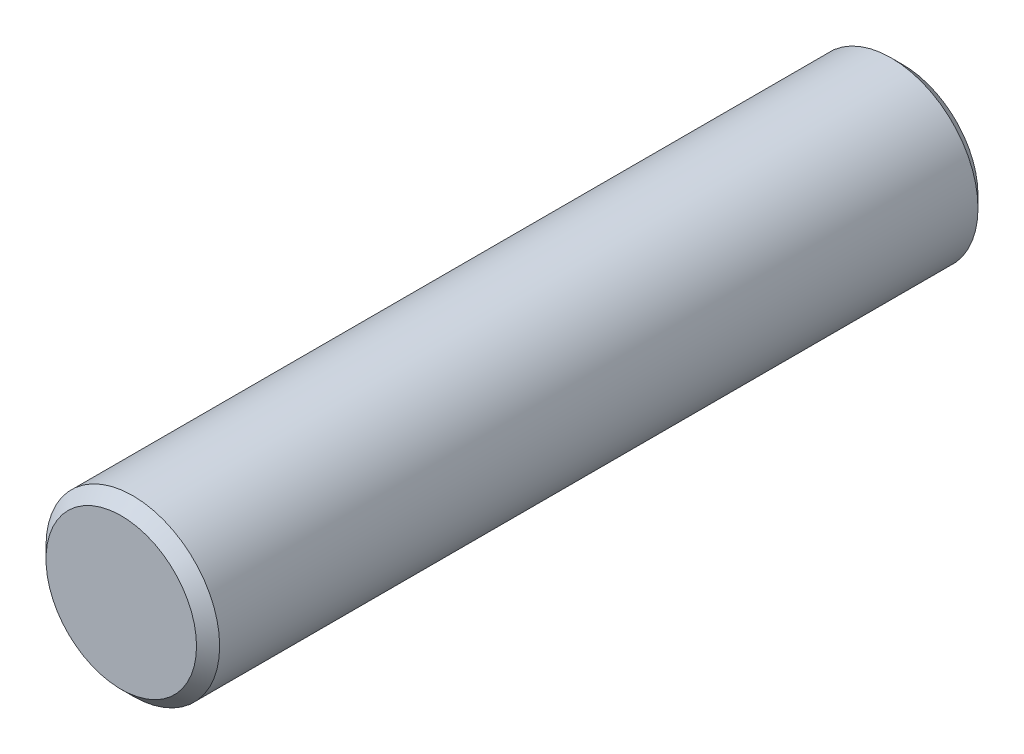
ISO-10303-21;
HEADER;
FILE_DESCRIPTION(('STEP AP214'),'2;1');
FILE_NAME('part.step','',(''),(''),'','','');
FILE_SCHEMA(('AUTOMOTIVE_DESIGN { 1 0 10303 214 1 1 1 1 }'));
ENDSEC;
DATA;
#1=APPLICATION_CONTEXT('core data for automotive mechanical design processes');
#2=APPLICATION_PROTOCOL_DEFINITION('international standard','automotive_design',2000,#1);
#3=PRODUCT_CONTEXT('',#1,'mechanical');
#4=PRODUCT('Part','Part','',(#3));
#5=PRODUCT_RELATED_PRODUCT_CATEGORY('part','',(#4));
#6=PRODUCT_DEFINITION_FORMATION('','',#4);
#7=PRODUCT_DEFINITION_CONTEXT('part definition',#1,'design');
#8=PRODUCT_DEFINITION('design','',#6,#7);
#9=PRODUCT_DEFINITION_SHAPE('','',#8);
#10=(LENGTH_UNIT() NAMED_UNIT(*) SI_UNIT(.MILLI.,.METRE.));
#11=(NAMED_UNIT(*) PLANE_ANGLE_UNIT() SI_UNIT($,.RADIAN.));
#12=(NAMED_UNIT(*) SI_UNIT($,.STERADIAN.) SOLID_ANGLE_UNIT());
#13=UNCERTAINTY_MEASURE_WITH_UNIT(LENGTH_MEASURE(1.E-05),#10,'distance_accuracy_value','');
#14=(GEOMETRIC_REPRESENTATION_CONTEXT(3) GLOBAL_UNCERTAINTY_ASSIGNED_CONTEXT((#13)) GLOBAL_UNIT_ASSIGNED_CONTEXT((#10,
#11,#12)) REPRESENTATION_CONTEXT('',''));
#15=CARTESIAN_POINT('',(0.,0.,0.));
#16=DIRECTION('',(0.,0.,1.));
#17=DIRECTION('',(1.,0.,0.));
#18=AXIS2_PLACEMENT_3D('',#15,#16,#17);
#19=CARTESIAN_POINT('',(0.,0.,13.5));
#20=DIRECTION('',(0.,0.,-1.));
#21=DIRECTION('',(-1.,0.,0.));
#22=AXIS2_PLACEMENT_3D('',#19,#20,#21);
#23=CYLINDRICAL_SURFACE('',#22,1.5);
#24=CARTESIAN_POINT('',(0.,0.,13.3));
#25=DIRECTION('',(0.,0.,1.));
#26=DIRECTION('',(1.,0.,0.));
#27=AXIS2_PLACEMENT_3D('',#24,#25,#26);
#28=CIRCLE('',#27,1.5);
#29=CARTESIAN_POINT('',(1.5,0.,13.3));
#30=VERTEX_POINT('',#29);
#31=EDGE_CURVE('E41',#30,#30,#28,.F.);
#32=ORIENTED_EDGE('',*,*,#31,.T.);
#33=EDGE_LOOP('',(#32));
#34=FACE_BOUND('',#33,.T.);
#35=CARTESIAN_POINT('',(0.,0.,0.199999999999997));
#36=DIRECTION('',(0.,0.,1.));
#37=DIRECTION('',(1.,0.,0.));
#38=AXIS2_PLACEMENT_3D('',#35,#36,#37);
#39=CIRCLE('',#38,1.5);
#40=CARTESIAN_POINT('',(1.5,0.,0.199999999999997));
#41=VERTEX_POINT('',#40);
#42=EDGE_CURVE('E45',#41,#41,#39,.T.);
#43=ORIENTED_EDGE('',*,*,#42,.T.);
#44=EDGE_LOOP('',(#43));
#45=FACE_BOUND('',#44,.T.);
#46=ADVANCED_FACE('F33',(#34,#45),#23,.T.);
#47=CARTESIAN_POINT('',(0.,0.,13.5));
#48=DIRECTION('',(0.,0.,1.));
#49=DIRECTION('',(1.,0.,0.));
#50=AXIS2_PLACEMENT_3D('',#47,#48,#49);
#51=PLANE('',#50);
#52=CARTESIAN_POINT('',(0.,0.,13.5));
#53=DIRECTION('',(0.,0.,1.));
#54=DIRECTION('',(1.,0.,0.));
#55=AXIS2_PLACEMENT_3D('',#52,#53,#54);
#56=CIRCLE('',#55,1.3);
#57=CARTESIAN_POINT('',(1.3,0.,13.5));
#58=VERTEX_POINT('',#57);
#59=EDGE_CURVE('E49',#58,#58,#56,.T.);
#60=ORIENTED_EDGE('',*,*,#59,.T.);
#61=EDGE_LOOP('',(#60));
#62=FACE_BOUND('',#61,.T.);
#63=ADVANCED_FACE('F55',(#62),#51,.T.);
#64=CARTESIAN_POINT('',(0.,0.,0.));
#65=DIRECTION('',(0.,0.,1.));
#66=DIRECTION('',(1.,0.,0.));
#67=AXIS2_PLACEMENT_3D('',#64,#65,#66);
#68=PLANE('',#67);
#69=CARTESIAN_POINT('',(0.,0.,0.));
#70=DIRECTION('',(0.,0.,1.));
#71=DIRECTION('',(1.,0.,0.));
#72=AXIS2_PLACEMENT_3D('',#69,#70,#71);
#73=CIRCLE('',#72,1.3);
#74=CARTESIAN_POINT('',(1.3,0.,0.));
#75=VERTEX_POINT('',#74);
#76=EDGE_CURVE('E10',#75,#75,#73,.F.);
#77=ORIENTED_EDGE('',*,*,#76,.T.);
#78=EDGE_LOOP('',(#77));
#79=FACE_BOUND('',#78,.T.);
#80=ADVANCED_FACE('F59',(#79),#68,.F.);
#81=CARTESIAN_POINT('',(0.,0.,13.5));
#82=DIRECTION('',(0.,0.,-1.));
#83=DIRECTION('',(-1.,0.,0.));
#84=AXIS2_PLACEMENT_3D('',#81,#82,#83);
#85=CONICAL_SURFACE('',#84,1.3,0.78539816339745);
#86=ORIENTED_EDGE('',*,*,#31,.F.);
#87=EDGE_LOOP('',(#86));
#88=FACE_BOUND('',#87,.T.);
#89=ORIENTED_EDGE('',*,*,#59,.F.);
#90=EDGE_LOOP('',(#89));
#91=FACE_BOUND('',#90,.T.);
#92=ADVANCED_FACE('F57',(#88,#91),#85,.T.);
#93=CARTESIAN_POINT('',(0.,0.,0.199999999999997));
#94=DIRECTION('',(0.,0.,1.));
#95=DIRECTION('',(1.,0.,0.));
#96=AXIS2_PLACEMENT_3D('',#93,#94,#95);
#97=CONICAL_SURFACE('',#96,1.5,0.785398163397454);
#98=ORIENTED_EDGE('',*,*,#76,.F.);
#99=EDGE_LOOP('',(#98));
#100=FACE_BOUND('',#99,.T.);
#101=ORIENTED_EDGE('',*,*,#42,.F.);
#102=EDGE_LOOP('',(#101));
#103=FACE_BOUND('',#102,.T.);
#104=ADVANCED_FACE('F36',(#100,#103),#97,.T.);
#105=CLOSED_SHELL('',(#46,#63,#80,#92,#104));
#106=MANIFOLD_SOLID_BREP('B2',#105);
#107=ADVANCED_BREP_SHAPE_REPRESENTATION('',(#18,#106),#14);
#108=SHAPE_DEFINITION_REPRESENTATION(#9,#107);
ENDSEC;
END-ISO-10303-21;
